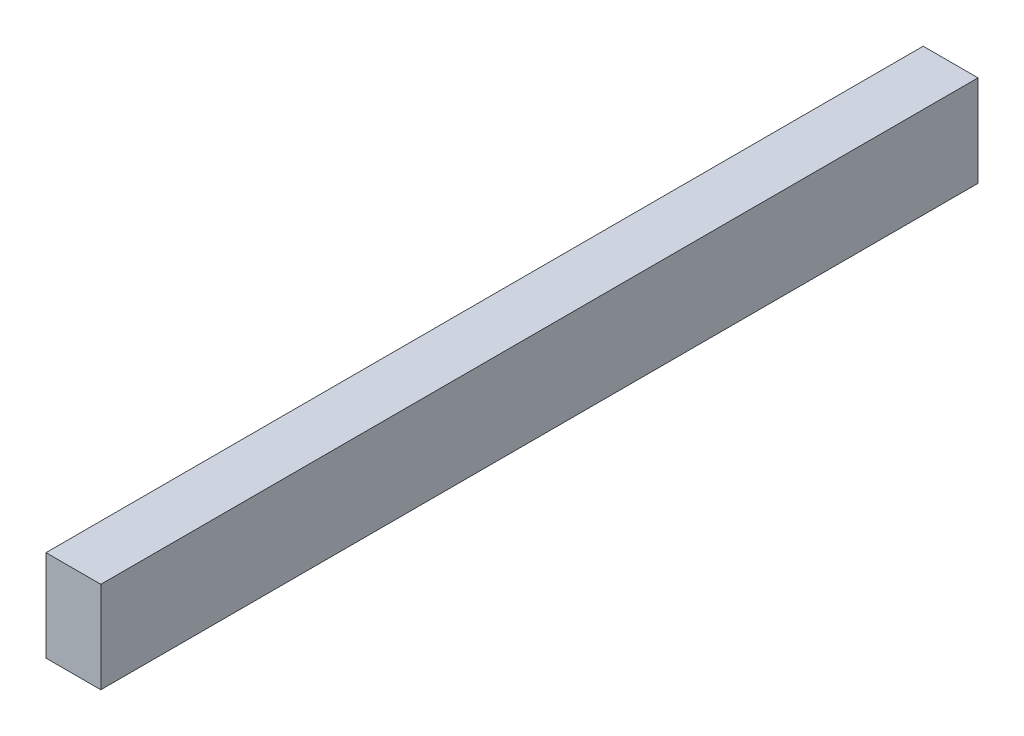
ISO-10303-21;
HEADER;
FILE_DESCRIPTION(('STEP AP214'),'2;1');
FILE_NAME('part.step','',(''),(''),'','','');
FILE_SCHEMA(('AUTOMOTIVE_DESIGN { 1 0 10303 214 1 1 1 1 }'));
ENDSEC;
DATA;
#1=APPLICATION_CONTEXT('core data for automotive mechanical design processes');
#2=APPLICATION_PROTOCOL_DEFINITION('international standard','automotive_design',2000,#1);
#3=PRODUCT_CONTEXT('',#1,'mechanical');
#4=PRODUCT('Part','Part','',(#3));
#5=PRODUCT_RELATED_PRODUCT_CATEGORY('part','',(#4));
#6=PRODUCT_DEFINITION_FORMATION('','',#4);
#7=PRODUCT_DEFINITION_CONTEXT('part definition',#1,'design');
#8=PRODUCT_DEFINITION('design','',#6,#7);
#9=PRODUCT_DEFINITION_SHAPE('','',#8);
#10=(LENGTH_UNIT() NAMED_UNIT(*) SI_UNIT(.MILLI.,.METRE.));
#11=(NAMED_UNIT(*) PLANE_ANGLE_UNIT() SI_UNIT($,.RADIAN.));
#12=(NAMED_UNIT(*) SI_UNIT($,.STERADIAN.) SOLID_ANGLE_UNIT());
#13=UNCERTAINTY_MEASURE_WITH_UNIT(LENGTH_MEASURE(1.E-05),#10,'distance_accuracy_value','');
#14=(GEOMETRIC_REPRESENTATION_CONTEXT(3) GLOBAL_UNCERTAINTY_ASSIGNED_CONTEXT((#13)) GLOBAL_UNIT_ASSIGNED_CONTEXT((#10,
#11,#12)) REPRESENTATION_CONTEXT('',''));
#15=CARTESIAN_POINT('',(0.,0.,0.));
#16=DIRECTION('',(0.,0.,1.));
#17=DIRECTION('',(1.,0.,0.));
#18=AXIS2_PLACEMENT_3D('',#15,#16,#17);
#19=CARTESIAN_POINT('',(19.05,-31.75,609.6));
#20=DIRECTION('',(-1.,0.,0.));
#21=DIRECTION('',(0.,0.,1.));
#22=AXIS2_PLACEMENT_3D('',#19,#20,#21);
#23=PLANE('',#22);
#24=DIRECTION('',(0.,1.,0.));
#25=VECTOR('',#24,1.);
#26=CARTESIAN_POINT('',(19.05,-31.75,0.));
#27=LINE('',#26,#25);
#28=CARTESIAN_POINT('',(19.05,-31.75,0.));
#29=VERTEX_POINT('',#28);
#30=CARTESIAN_POINT('',(19.05,31.75,0.));
#31=VERTEX_POINT('',#30);
#32=EDGE_CURVE('E96',#29,#31,#27,.T.);
#33=ORIENTED_EDGE('',*,*,#32,.T.);
#34=DIRECTION('',(0.,0.,-1.));
#35=VECTOR('',#34,1.);
#36=CARTESIAN_POINT('',(19.05,31.75,609.6));
#37=LINE('',#36,#35);
#38=CARTESIAN_POINT('',(19.05,31.75,609.6));
#39=VERTEX_POINT('',#38);
#40=EDGE_CURVE('E11',#39,#31,#37,.T.);
#41=ORIENTED_EDGE('',*,*,#40,.F.);
#42=DIRECTION('',(0.,1.,0.));
#43=VECTOR('',#42,1.);
#44=CARTESIAN_POINT('',(19.05,-31.75,609.6));
#45=LINE('',#44,#43);
#46=CARTESIAN_POINT('',(19.05,-31.75,609.6));
#47=VERTEX_POINT('',#46);
#48=EDGE_CURVE('E84',#47,#39,#45,.T.);
#49=ORIENTED_EDGE('',*,*,#48,.F.);
#50=DIRECTION('',(0.,0.,-1.));
#51=VECTOR('',#50,1.);
#52=CARTESIAN_POINT('',(19.05,-31.75,609.6));
#53=LINE('',#52,#51);
#54=EDGE_CURVE('E92',#47,#29,#53,.T.);
#55=ORIENTED_EDGE('',*,*,#54,.T.);
#56=EDGE_LOOP('',(#33,#41,#49,#55));
#57=FACE_BOUND('',#56,.T.);
#58=ADVANCED_FACE('F33',(#57),#23,.F.);
#59=CARTESIAN_POINT('',(-19.05,31.75,609.6));
#60=DIRECTION('',(0.,-1.,0.));
#61=DIRECTION('',(0.,0.,-1.));
#62=AXIS2_PLACEMENT_3D('',#59,#60,#61);
#63=PLANE('',#62);
#64=DIRECTION('',(-1.,0.,0.));
#65=VECTOR('',#64,1.);
#66=CARTESIAN_POINT('',(-19.05,31.75,0.));
#67=LINE('',#66,#65);
#68=CARTESIAN_POINT('',(-19.05,31.75,0.));
#69=VERTEX_POINT('',#68);
#70=EDGE_CURVE('E88',#31,#69,#67,.T.);
#71=ORIENTED_EDGE('',*,*,#70,.T.);
#72=DIRECTION('',(0.,0.,-1.));
#73=VECTOR('',#72,1.);
#74=CARTESIAN_POINT('',(-19.05,31.75,609.6));
#75=LINE('',#74,#73);
#76=CARTESIAN_POINT('',(-19.05,31.75,609.6));
#77=VERTEX_POINT('',#76);
#78=EDGE_CURVE('E41',#77,#69,#75,.T.);
#79=ORIENTED_EDGE('',*,*,#78,.F.);
#80=DIRECTION('',(-1.,0.,0.));
#81=VECTOR('',#80,1.);
#82=CARTESIAN_POINT('',(-19.05,31.75,609.6));
#83=LINE('',#82,#81);
#84=EDGE_CURVE('E79',#39,#77,#83,.T.);
#85=ORIENTED_EDGE('',*,*,#84,.F.);
#86=ORIENTED_EDGE('',*,*,#40,.T.);
#87=EDGE_LOOP('',(#71,#79,#85,#86));
#88=FACE_BOUND('',#87,.T.);
#89=ADVANCED_FACE('F87',(#88),#63,.F.);
#90=CARTESIAN_POINT('',(-19.05,-31.75,609.6));
#91=DIRECTION('',(1.,0.,0.));
#92=DIRECTION('',(0.,0.,-1.));
#93=AXIS2_PLACEMENT_3D('',#90,#91,#92);
#94=PLANE('',#93);
#95=DIRECTION('',(0.,-1.,0.));
#96=VECTOR('',#95,1.);
#97=CARTESIAN_POINT('',(-19.05,-31.75,0.));
#98=LINE('',#97,#96);
#99=CARTESIAN_POINT('',(-19.05,-31.75,0.));
#100=VERTEX_POINT('',#99);
#101=EDGE_CURVE('E66',#69,#100,#98,.T.);
#102=ORIENTED_EDGE('',*,*,#101,.T.);
#103=DIRECTION('',(0.,0.,-1.));
#104=VECTOR('',#103,1.);
#105=CARTESIAN_POINT('',(-19.05,-31.75,609.6));
#106=LINE('',#105,#104);
#107=CARTESIAN_POINT('',(-19.05,-31.75,609.6));
#108=VERTEX_POINT('',#107);
#109=EDGE_CURVE('E89',#108,#100,#106,.T.);
#110=ORIENTED_EDGE('',*,*,#109,.F.);
#111=DIRECTION('',(0.,-1.,0.));
#112=VECTOR('',#111,1.);
#113=CARTESIAN_POINT('',(-19.05,-31.75,609.6));
#114=LINE('',#113,#112);
#115=EDGE_CURVE('E82',#77,#108,#114,.T.);
#116=ORIENTED_EDGE('',*,*,#115,.F.);
#117=ORIENTED_EDGE('',*,*,#78,.T.);
#118=EDGE_LOOP('',(#102,#110,#116,#117));
#119=FACE_BOUND('',#118,.T.);
#120=ADVANCED_FACE('F90',(#119),#94,.F.);
#121=CARTESIAN_POINT('',(-19.05,-31.75,609.6));
#122=DIRECTION('',(0.,1.,0.));
#123=DIRECTION('',(0.,0.,1.));
#124=AXIS2_PLACEMENT_3D('',#121,#122,#123);
#125=PLANE('',#124);
#126=DIRECTION('',(1.,0.,0.));
#127=VECTOR('',#126,1.);
#128=CARTESIAN_POINT('',(-19.05,-31.75,0.));
#129=LINE('',#128,#127);
#130=EDGE_CURVE('E72',#100,#29,#129,.T.);
#131=ORIENTED_EDGE('',*,*,#130,.T.);
#132=ORIENTED_EDGE('',*,*,#54,.F.);
#133=DIRECTION('',(1.,0.,0.));
#134=VECTOR('',#133,1.);
#135=CARTESIAN_POINT('',(-19.05,-31.75,609.6));
#136=LINE('',#135,#134);
#137=EDGE_CURVE('E49',#108,#47,#136,.T.);
#138=ORIENTED_EDGE('',*,*,#137,.F.);
#139=ORIENTED_EDGE('',*,*,#109,.T.);
#140=EDGE_LOOP('',(#131,#132,#138,#139));
#141=FACE_BOUND('',#140,.T.);
#142=ADVANCED_FACE('F103',(#141),#125,.F.);
#143=CARTESIAN_POINT('',(0.,0.,609.6));
#144=DIRECTION('',(0.,0.,-1.));
#145=DIRECTION('',(-1.,0.,0.));
#146=AXIS2_PLACEMENT_3D('',#143,#144,#145);
#147=PLANE('',#146);
#148=ORIENTED_EDGE('',*,*,#48,.T.);
#149=ORIENTED_EDGE('',*,*,#84,.T.);
#150=ORIENTED_EDGE('',*,*,#115,.T.);
#151=ORIENTED_EDGE('',*,*,#137,.T.);
#152=EDGE_LOOP('',(#148,#149,#150,#151));
#153=FACE_BOUND('',#152,.T.);
#154=ADVANCED_FACE('F80',(#153),#147,.F.);
#155=CARTESIAN_POINT('',(0.,0.,0.));
#156=DIRECTION('',(0.,0.,-1.));
#157=DIRECTION('',(-1.,0.,0.));
#158=AXIS2_PLACEMENT_3D('',#155,#156,#157);
#159=PLANE('',#158);
#160=ORIENTED_EDGE('',*,*,#32,.F.);
#161=ORIENTED_EDGE('',*,*,#130,.F.);
#162=ORIENTED_EDGE('',*,*,#101,.F.);
#163=ORIENTED_EDGE('',*,*,#70,.F.);
#164=EDGE_LOOP('',(#160,#161,#162,#163));
#165=FACE_BOUND('',#164,.T.);
#166=ADVANCED_FACE('F106',(#165),#159,.T.);
#167=CLOSED_SHELL('',(#58,#89,#120,#142,#154,#166));
#168=MANIFOLD_SOLID_BREP('B2',#167);
#169=ADVANCED_BREP_SHAPE_REPRESENTATION('',(#18,#168),#14);
#170=SHAPE_DEFINITION_REPRESENTATION(#9,#169);
ENDSEC;
END-ISO-10303-21;
